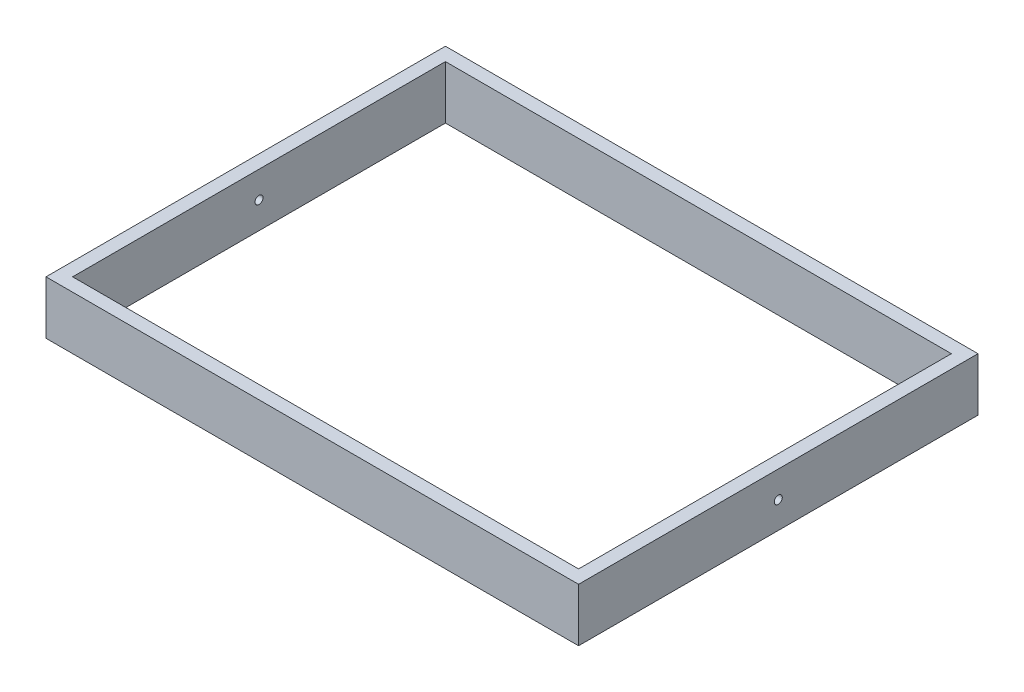
ISO-10303-21;
HEADER;
FILE_DESCRIPTION(('STEP AP214'),'2;1');
FILE_NAME('part.step','',(''),(''),'','','');
FILE_SCHEMA(('AUTOMOTIVE_DESIGN { 1 0 10303 214 1 1 1 1 }'));
ENDSEC;
DATA;
#1=APPLICATION_CONTEXT('core data for automotive mechanical design processes');
#2=APPLICATION_PROTOCOL_DEFINITION('international standard','automotive_design',2000,#1);
#3=PRODUCT_CONTEXT('',#1,'mechanical');
#4=PRODUCT('Part','Part','',(#3));
#5=PRODUCT_RELATED_PRODUCT_CATEGORY('part','',(#4));
#6=PRODUCT_DEFINITION_FORMATION('','',#4);
#7=PRODUCT_DEFINITION_CONTEXT('part definition',#1,'design');
#8=PRODUCT_DEFINITION('design','',#6,#7);
#9=PRODUCT_DEFINITION_SHAPE('','',#8);
#10=(LENGTH_UNIT() NAMED_UNIT(*) SI_UNIT(.MILLI.,.METRE.));
#11=(NAMED_UNIT(*) PLANE_ANGLE_UNIT() SI_UNIT($,.RADIAN.));
#12=(NAMED_UNIT(*) SI_UNIT($,.STERADIAN.) SOLID_ANGLE_UNIT());
#13=UNCERTAINTY_MEASURE_WITH_UNIT(LENGTH_MEASURE(1.E-05),#10,'distance_accuracy_value','');
#14=(GEOMETRIC_REPRESENTATION_CONTEXT(3) GLOBAL_UNCERTAINTY_ASSIGNED_CONTEXT((#13)) GLOBAL_UNIT_ASSIGNED_CONTEXT((#10,
#11,#12)) REPRESENTATION_CONTEXT('',''));
#15=CARTESIAN_POINT('',(0.,0.,0.));
#16=DIRECTION('',(0.,0.,1.));
#17=DIRECTION('',(1.,0.,0.));
#18=AXIS2_PLACEMENT_3D('',#15,#16,#17);
#19=CARTESIAN_POINT('',(-200.,40.,150.));
#20=DIRECTION('',(1.,0.,0.));
#21=DIRECTION('',(0.,0.,-1.));
#22=AXIS2_PLACEMENT_3D('',#19,#20,#21);
#23=PLANE('',#22);
#24=CARTESIAN_POINT('',(-200.,20.,0.));
#25=DIRECTION('',(1.,0.,0.));
#26=DIRECTION('',(0.,0.,-1.));
#27=AXIS2_PLACEMENT_3D('',#24,#25,#26);
#28=CIRCLE('',#27,3.);
#29=CARTESIAN_POINT('',(-200.,20.,-3.));
#30=VERTEX_POINT('',#29);
#31=EDGE_CURVE('E209',#30,#30,#28,.F.);
#32=ORIENTED_EDGE('',*,*,#31,.F.);
#33=EDGE_LOOP('',(#32));
#34=FACE_BOUND('',#33,.T.);
#35=DIRECTION('',(0.,0.,1.));
#36=VECTOR('',#35,1.);
#37=CARTESIAN_POINT('',(-200.,0.,150.));
#38=LINE('',#37,#36);
#39=CARTESIAN_POINT('',(-200.,0.,-150.));
#40=VERTEX_POINT('',#39);
#41=CARTESIAN_POINT('',(-200.,0.,150.));
#42=VERTEX_POINT('',#41);
#43=EDGE_CURVE('E152',#40,#42,#38,.T.);
#44=ORIENTED_EDGE('',*,*,#43,.T.);
#45=DIRECTION('',(0.,-1.,0.));
#46=VECTOR('',#45,1.);
#47=CARTESIAN_POINT('',(-200.,40.,150.));
#48=LINE('',#47,#46);
#49=CARTESIAN_POINT('',(-200.,40.,150.));
#50=VERTEX_POINT('',#49);
#51=EDGE_CURVE('E157',#50,#42,#48,.T.);
#52=ORIENTED_EDGE('',*,*,#51,.F.);
#53=DIRECTION('',(0.,0.,1.));
#54=VECTOR('',#53,1.);
#55=CARTESIAN_POINT('',(-200.,40.,150.));
#56=LINE('',#55,#54);
#57=CARTESIAN_POINT('',(-200.,40.,-150.));
#58=VERTEX_POINT('',#57);
#59=EDGE_CURVE('E143',#58,#50,#56,.T.);
#60=ORIENTED_EDGE('',*,*,#59,.F.);
#61=DIRECTION('',(0.,-1.,0.));
#62=VECTOR('',#61,1.);
#63=CARTESIAN_POINT('',(-200.,40.,-150.));
#64=LINE('',#63,#62);
#65=EDGE_CURVE('E160',#58,#40,#64,.T.);
#66=ORIENTED_EDGE('',*,*,#65,.T.);
#67=EDGE_LOOP('',(#44,#52,#60,#66));
#68=FACE_BOUND('',#67,.T.);
#69=CARTESIAN_POINT('',(-200.,20.,110.));
#70=DIRECTION('',(1.,0.,0.));
#71=DIRECTION('',(0.,0.,-1.));
#72=AXIS2_PLACEMENT_3D('',#69,#70,#71);
#73=CIRCLE('',#72,2.99999999999999);
#74=CARTESIAN_POINT('',(-200.,20.,107.));
#75=VERTEX_POINT('',#74);
#76=EDGE_CURVE('E11',#75,#75,#73,.F.);
#77=ORIENTED_EDGE('',*,*,#76,.F.);
#78=EDGE_LOOP('',(#77));
#79=FACE_BOUND('',#78,.T.);
#80=ADVANCED_FACE('F32',(#34,#68,#79),#23,.F.);
#81=CARTESIAN_POINT('',(0.,40.,0.));
#82=DIRECTION('',(0.,-1.,0.));
#83=DIRECTION('',(0.,0.,-1.));
#84=AXIS2_PLACEMENT_3D('',#81,#82,#83);
#85=PLANE('',#84);
#86=DIRECTION('',(0.,0.,-1.));
#87=VECTOR('',#86,1.);
#88=CARTESIAN_POINT('',(200.,40.,150.));
#89=LINE('',#88,#87);
#90=CARTESIAN_POINT('',(200.,40.,150.));
#91=VERTEX_POINT('',#90);
#92=CARTESIAN_POINT('',(200.,40.,-150.));
#93=VERTEX_POINT('',#92);
#94=EDGE_CURVE('E137',#91,#93,#89,.T.);
#95=ORIENTED_EDGE('',*,*,#94,.T.);
#96=DIRECTION('',(-1.,0.,0.));
#97=VECTOR('',#96,1.);
#98=CARTESIAN_POINT('',(-200.,40.,-150.));
#99=LINE('',#98,#97);
#100=EDGE_CURVE('E140',#93,#58,#99,.T.);
#101=ORIENTED_EDGE('',*,*,#100,.T.);
#102=ORIENTED_EDGE('',*,*,#59,.T.);
#103=DIRECTION('',(1.,0.,0.));
#104=VECTOR('',#103,1.);
#105=CARTESIAN_POINT('',(-200.,40.,150.));
#106=LINE('',#105,#104);
#107=EDGE_CURVE('E145',#50,#91,#106,.T.);
#108=ORIENTED_EDGE('',*,*,#107,.T.);
#109=EDGE_LOOP('',(#95,#101,#102,#108));
#110=FACE_BOUND('',#109,.T.);
#111=DIRECTION('',(0.,0.,1.));
#112=VECTOR('',#111,1.);
#113=CARTESIAN_POINT('',(-190.,40.,140.));
#114=LINE('',#113,#112);
#115=CARTESIAN_POINT('',(-190.,40.,-140.));
#116=VERTEX_POINT('',#115);
#117=CARTESIAN_POINT('',(-190.,40.,140.));
#118=VERTEX_POINT('',#117);
#119=EDGE_CURVE('E98',#116,#118,#114,.T.);
#120=ORIENTED_EDGE('',*,*,#119,.F.);
#121=DIRECTION('',(-1.,0.,0.));
#122=VECTOR('',#121,1.);
#123=CARTESIAN_POINT('',(-190.,40.,-140.));
#124=LINE('',#123,#122);
#125=CARTESIAN_POINT('',(190.,40.,-140.));
#126=VERTEX_POINT('',#125);
#127=EDGE_CURVE('E121',#126,#116,#124,.T.);
#128=ORIENTED_EDGE('',*,*,#127,.F.);
#129=DIRECTION('',(0.,0.,-1.));
#130=VECTOR('',#129,1.);
#131=CARTESIAN_POINT('',(190.,40.,140.));
#132=LINE('',#131,#130);
#133=CARTESIAN_POINT('',(190.,40.,140.));
#134=VERTEX_POINT('',#133);
#135=EDGE_CURVE('E119',#134,#126,#132,.T.);
#136=ORIENTED_EDGE('',*,*,#135,.F.);
#137=DIRECTION('',(1.,0.,0.));
#138=VECTOR('',#137,1.);
#139=CARTESIAN_POINT('',(-190.,40.,140.));
#140=LINE('',#139,#138);
#141=EDGE_CURVE('E106',#118,#134,#140,.T.);
#142=ORIENTED_EDGE('',*,*,#141,.F.);
#143=EDGE_LOOP('',(#120,#128,#136,#142));
#144=FACE_BOUND('',#143,.T.);
#145=ADVANCED_FACE('F118',(#110,#144),#85,.F.);
#146=CARTESIAN_POINT('',(0.,0.,0.));
#147=DIRECTION('',(0.,-1.,0.));
#148=DIRECTION('',(0.,0.,-1.));
#149=AXIS2_PLACEMENT_3D('',#146,#147,#148);
#150=PLANE('',#149);
#151=DIRECTION('',(0.,0.,-1.));
#152=VECTOR('',#151,1.);
#153=CARTESIAN_POINT('',(200.,0.,150.));
#154=LINE('',#153,#152);
#155=CARTESIAN_POINT('',(200.,0.,150.));
#156=VERTEX_POINT('',#155);
#157=CARTESIAN_POINT('',(200.,0.,-150.));
#158=VERTEX_POINT('',#157);
#159=EDGE_CURVE('E114',#156,#158,#154,.T.);
#160=ORIENTED_EDGE('',*,*,#159,.F.);
#161=DIRECTION('',(1.,0.,0.));
#162=VECTOR('',#161,1.);
#163=CARTESIAN_POINT('',(-200.,0.,150.));
#164=LINE('',#163,#162);
#165=EDGE_CURVE('E141',#42,#156,#164,.T.);
#166=ORIENTED_EDGE('',*,*,#165,.F.);
#167=ORIENTED_EDGE('',*,*,#43,.F.);
#168=DIRECTION('',(-1.,0.,0.));
#169=VECTOR('',#168,1.);
#170=CARTESIAN_POINT('',(-200.,0.,-150.));
#171=LINE('',#170,#169);
#172=EDGE_CURVE('E150',#158,#40,#171,.T.);
#173=ORIENTED_EDGE('',*,*,#172,.F.);
#174=EDGE_LOOP('',(#160,#166,#167,#173));
#175=FACE_BOUND('',#174,.T.);
#176=DIRECTION('',(-1.,0.,0.));
#177=VECTOR('',#176,1.);
#178=CARTESIAN_POINT('',(-190.,0.,-140.));
#179=LINE('',#178,#177);
#180=CARTESIAN_POINT('',(190.,0.,-140.));
#181=VERTEX_POINT('',#180);
#182=CARTESIAN_POINT('',(-190.,0.,-140.));
#183=VERTEX_POINT('',#182);
#184=EDGE_CURVE('E107',#181,#183,#179,.T.);
#185=ORIENTED_EDGE('',*,*,#184,.T.);
#186=DIRECTION('',(0.,0.,1.));
#187=VECTOR('',#186,1.);
#188=CARTESIAN_POINT('',(-190.,0.,140.));
#189=LINE('',#188,#187);
#190=CARTESIAN_POINT('',(-190.,0.,140.));
#191=VERTEX_POINT('',#190);
#192=EDGE_CURVE('E56',#183,#191,#189,.T.);
#193=ORIENTED_EDGE('',*,*,#192,.T.);
#194=DIRECTION('',(1.,0.,0.));
#195=VECTOR('',#194,1.);
#196=CARTESIAN_POINT('',(-190.,0.,140.));
#197=LINE('',#196,#195);
#198=CARTESIAN_POINT('',(190.,0.,140.));
#199=VERTEX_POINT('',#198);
#200=EDGE_CURVE('E113',#191,#199,#197,.T.);
#201=ORIENTED_EDGE('',*,*,#200,.T.);
#202=DIRECTION('',(0.,0.,-1.));
#203=VECTOR('',#202,1.);
#204=CARTESIAN_POINT('',(190.,0.,140.));
#205=LINE('',#204,#203);
#206=EDGE_CURVE('E129',#199,#181,#205,.T.);
#207=ORIENTED_EDGE('',*,*,#206,.T.);
#208=EDGE_LOOP('',(#185,#193,#201,#207));
#209=FACE_BOUND('',#208,.T.);
#210=ADVANCED_FACE('F174',(#175,#209),#150,.T.);
#211=CARTESIAN_POINT('',(200.,40.,150.));
#212=DIRECTION('',(-1.,0.,0.));
#213=DIRECTION('',(0.,0.,1.));
#214=AXIS2_PLACEMENT_3D('',#211,#212,#213);
#215=PLANE('',#214);
#216=CARTESIAN_POINT('',(200.,20.,0.));
#217=DIRECTION('',(1.,0.,0.));
#218=DIRECTION('',(0.,0.,-1.));
#219=AXIS2_PLACEMENT_3D('',#216,#217,#218);
#220=CIRCLE('',#219,3.);
#221=CARTESIAN_POINT('',(200.,20.,-3.));
#222=VERTEX_POINT('',#221);
#223=EDGE_CURVE('E207',#222,#222,#220,.T.);
#224=ORIENTED_EDGE('',*,*,#223,.F.);
#225=EDGE_LOOP('',(#224));
#226=FACE_BOUND('',#225,.T.);
#227=ORIENTED_EDGE('',*,*,#159,.T.);
#228=DIRECTION('',(0.,-1.,0.));
#229=VECTOR('',#228,1.);
#230=CARTESIAN_POINT('',(200.,40.,-150.));
#231=LINE('',#230,#229);
#232=EDGE_CURVE('E41',#93,#158,#231,.T.);
#233=ORIENTED_EDGE('',*,*,#232,.F.);
#234=ORIENTED_EDGE('',*,*,#94,.F.);
#235=DIRECTION('',(0.,-1.,0.));
#236=VECTOR('',#235,1.);
#237=CARTESIAN_POINT('',(200.,40.,150.));
#238=LINE('',#237,#236);
#239=EDGE_CURVE('E147',#91,#156,#238,.T.);
#240=ORIENTED_EDGE('',*,*,#239,.T.);
#241=EDGE_LOOP('',(#227,#233,#234,#240));
#242=FACE_BOUND('',#241,.T.);
#243=ADVANCED_FACE('F34',(#226,#242),#215,.F.);
#244=CARTESIAN_POINT('',(-200.,40.,-150.));
#245=DIRECTION('',(0.,0.,1.));
#246=DIRECTION('',(1.,0.,0.));
#247=AXIS2_PLACEMENT_3D('',#244,#245,#246);
#248=PLANE('',#247);
#249=ORIENTED_EDGE('',*,*,#172,.T.);
#250=ORIENTED_EDGE('',*,*,#65,.F.);
#251=ORIENTED_EDGE('',*,*,#100,.F.);
#252=ORIENTED_EDGE('',*,*,#232,.T.);
#253=EDGE_LOOP('',(#249,#250,#251,#252));
#254=FACE_BOUND('',#253,.T.);
#255=ADVANCED_FACE('F166',(#254),#248,.F.);
#256=CARTESIAN_POINT('',(-200.,40.,150.));
#257=DIRECTION('',(0.,0.,-1.));
#258=DIRECTION('',(-1.,0.,0.));
#259=AXIS2_PLACEMENT_3D('',#256,#257,#258);
#260=PLANE('',#259);
#261=ORIENTED_EDGE('',*,*,#165,.T.);
#262=ORIENTED_EDGE('',*,*,#239,.F.);
#263=ORIENTED_EDGE('',*,*,#107,.F.);
#264=ORIENTED_EDGE('',*,*,#51,.T.);
#265=EDGE_LOOP('',(#261,#262,#263,#264));
#266=FACE_BOUND('',#265,.T.);
#267=ADVANCED_FACE('F183',(#266),#260,.F.);
#268=CARTESIAN_POINT('',(-190.,40.,140.));
#269=DIRECTION('',(1.,0.,0.));
#270=DIRECTION('',(0.,0.,-1.));
#271=AXIS2_PLACEMENT_3D('',#268,#269,#270);
#272=PLANE('',#271);
#273=CARTESIAN_POINT('',(-190.,20.,0.));
#274=DIRECTION('',(1.,0.,0.));
#275=DIRECTION('',(0.,0.,-1.));
#276=AXIS2_PLACEMENT_3D('',#273,#274,#275);
#277=CIRCLE('',#276,3.);
#278=CARTESIAN_POINT('',(-190.,20.,-3.));
#279=VERTEX_POINT('',#278);
#280=EDGE_CURVE('E214',#279,#279,#277,.T.);
#281=ORIENTED_EDGE('',*,*,#280,.F.);
#282=EDGE_LOOP('',(#281));
#283=FACE_BOUND('',#282,.T.);
#284=ORIENTED_EDGE('',*,*,#192,.F.);
#285=DIRECTION('',(0.,-1.,0.));
#286=VECTOR('',#285,1.);
#287=CARTESIAN_POINT('',(-190.,40.,-140.));
#288=LINE('',#287,#286);
#289=EDGE_CURVE('E102',#116,#183,#288,.T.);
#290=ORIENTED_EDGE('',*,*,#289,.F.);
#291=ORIENTED_EDGE('',*,*,#119,.T.);
#292=DIRECTION('',(0.,-1.,0.));
#293=VECTOR('',#292,1.);
#294=CARTESIAN_POINT('',(-190.,40.,140.));
#295=LINE('',#294,#293);
#296=EDGE_CURVE('E101',#118,#191,#295,.T.);
#297=ORIENTED_EDGE('',*,*,#296,.T.);
#298=EDGE_LOOP('',(#284,#290,#291,#297));
#299=FACE_BOUND('',#298,.T.);
#300=ADVANCED_FACE('F100',(#283,#299),#272,.T.);
#301=CARTESIAN_POINT('',(-190.,40.,140.));
#302=DIRECTION('',(0.,0.,-1.));
#303=DIRECTION('',(-1.,0.,0.));
#304=AXIS2_PLACEMENT_3D('',#301,#302,#303);
#305=PLANE('',#304);
#306=ORIENTED_EDGE('',*,*,#200,.F.);
#307=ORIENTED_EDGE('',*,*,#296,.F.);
#308=ORIENTED_EDGE('',*,*,#141,.T.);
#309=DIRECTION('',(0.,-1.,0.));
#310=VECTOR('',#309,1.);
#311=CARTESIAN_POINT('',(190.,40.,140.));
#312=LINE('',#311,#310);
#313=EDGE_CURVE('E115',#134,#199,#312,.T.);
#314=ORIENTED_EDGE('',*,*,#313,.T.);
#315=EDGE_LOOP('',(#306,#307,#308,#314));
#316=FACE_BOUND('',#315,.T.);
#317=ADVANCED_FACE('F110',(#316),#305,.T.);
#318=CARTESIAN_POINT('',(190.,40.,140.));
#319=DIRECTION('',(-1.,0.,0.));
#320=DIRECTION('',(0.,0.,1.));
#321=AXIS2_PLACEMENT_3D('',#318,#319,#320);
#322=PLANE('',#321);
#323=CARTESIAN_POINT('',(190.,20.,0.));
#324=DIRECTION('',(-1.,0.,0.));
#325=DIRECTION('',(0.,0.,1.));
#326=AXIS2_PLACEMENT_3D('',#323,#324,#325);
#327=CIRCLE('',#326,3.);
#328=CARTESIAN_POINT('',(190.,20.,3.));
#329=VERTEX_POINT('',#328);
#330=EDGE_CURVE('E36',#329,#329,#327,.T.);
#331=ORIENTED_EDGE('',*,*,#330,.F.);
#332=EDGE_LOOP('',(#331));
#333=FACE_BOUND('',#332,.T.);
#334=ORIENTED_EDGE('',*,*,#206,.F.);
#335=ORIENTED_EDGE('',*,*,#313,.F.);
#336=ORIENTED_EDGE('',*,*,#135,.T.);
#337=DIRECTION('',(0.,-1.,0.));
#338=VECTOR('',#337,1.);
#339=CARTESIAN_POINT('',(190.,40.,-140.));
#340=LINE('',#339,#338);
#341=EDGE_CURVE('E48',#126,#181,#340,.T.);
#342=ORIENTED_EDGE('',*,*,#341,.T.);
#343=EDGE_LOOP('',(#334,#335,#336,#342));
#344=FACE_BOUND('',#343,.T.);
#345=ADVANCED_FACE('F233',(#333,#344),#322,.T.);
#346=CARTESIAN_POINT('',(-190.,40.,-140.));
#347=DIRECTION('',(0.,0.,1.));
#348=DIRECTION('',(1.,0.,0.));
#349=AXIS2_PLACEMENT_3D('',#346,#347,#348);
#350=PLANE('',#349);
#351=ORIENTED_EDGE('',*,*,#184,.F.);
#352=ORIENTED_EDGE('',*,*,#341,.F.);
#353=ORIENTED_EDGE('',*,*,#127,.T.);
#354=ORIENTED_EDGE('',*,*,#289,.T.);
#355=EDGE_LOOP('',(#351,#352,#353,#354));
#356=FACE_BOUND('',#355,.T.);
#357=ADVANCED_FACE('F224',(#356),#350,.T.);
#358=CARTESIAN_POINT('',(-210.,20.,110.));
#359=DIRECTION('',(1.,0.,0.));
#360=DIRECTION('',(0.,0.,-1.));
#361=AXIS2_PLACEMENT_3D('',#358,#359,#360);
#362=CYLINDRICAL_SURFACE('',#361,2.99999999999999);
#363=CARTESIAN_POINT('',(-210.,20.,110.));
#364=DIRECTION('',(-1.,0.,0.));
#365=DIRECTION('',(0.,0.,1.));
#366=AXIS2_PLACEMENT_3D('',#363,#364,#365);
#367=CIRCLE('',#366,2.99999999999999);
#368=CARTESIAN_POINT('',(-210.,20.,113.));
#369=VERTEX_POINT('',#368);
#370=EDGE_CURVE('E127',#369,#369,#367,.T.);
#371=ORIENTED_EDGE('',*,*,#370,.F.);
#372=EDGE_LOOP('',(#371));
#373=FACE_BOUND('',#372,.T.);
#374=ORIENTED_EDGE('',*,*,#76,.T.);
#375=EDGE_LOOP('',(#374));
#376=FACE_BOUND('',#375,.T.);
#377=ADVANCED_FACE('F221',(#373,#376),#362,.T.);
#378=CARTESIAN_POINT('',(-210.,20.,110.));
#379=DIRECTION('',(-1.,0.,0.));
#380=DIRECTION('',(0.,0.,1.));
#381=AXIS2_PLACEMENT_3D('',#378,#379,#380);
#382=PLANE('',#381);
#383=ORIENTED_EDGE('',*,*,#370,.T.);
#384=EDGE_LOOP('',(#383));
#385=FACE_BOUND('',#384,.T.);
#386=ADVANCED_FACE('F219',(#385),#382,.T.);
#387=CARTESIAN_POINT('',(-208.485281374239,20.,0.));
#388=DIRECTION('',(1.,0.,0.));
#389=DIRECTION('',(0.,0.,-1.));
#390=AXIS2_PLACEMENT_3D('',#387,#388,#389);
#391=CYLINDRICAL_SURFACE('',#390,3.);
#392=ORIENTED_EDGE('',*,*,#330,.T.);
#393=EDGE_LOOP('',(#392));
#394=FACE_BOUND('',#393,.T.);
#395=ORIENTED_EDGE('',*,*,#223,.T.);
#396=EDGE_LOOP('',(#395));
#397=FACE_BOUND('',#396,.T.);
#398=ADVANCED_FACE('F231',(#394,#397),#391,.F.);
#399=ORIENTED_EDGE('',*,*,#280,.T.);
#400=EDGE_LOOP('',(#399));
#401=FACE_BOUND('',#400,.T.);
#402=ORIENTED_EDGE('',*,*,#31,.T.);
#403=EDGE_LOOP('',(#402));
#404=FACE_BOUND('',#403,.T.);
#405=ADVANCED_FACE('F248',(#401,#404),#391,.F.);
#406=CLOSED_SHELL('',(#80,#145,#210,#243,#255,#267,#300,#317,#345,#357,#377,#386,#398,#405));
#407=MANIFOLD_SOLID_BREP('B2',#406);
#408=ADVANCED_BREP_SHAPE_REPRESENTATION('',(#18,#407),#14);
#409=SHAPE_DEFINITION_REPRESENTATION(#9,#408);
ENDSEC;
END-ISO-10303-21;
